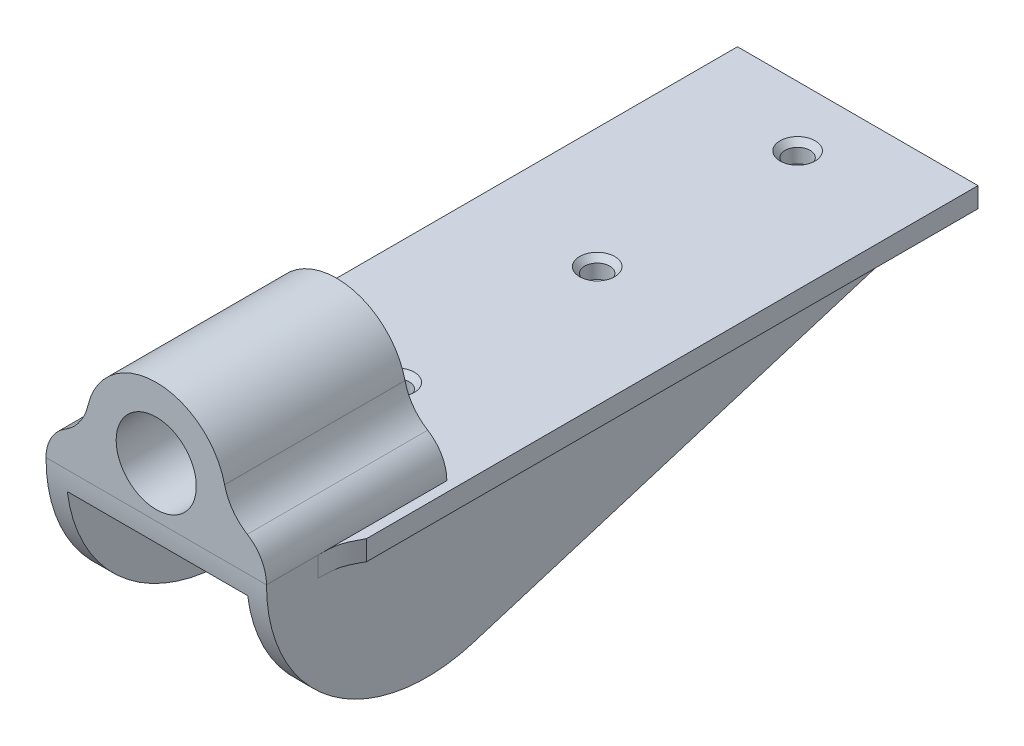
ISO-10303-21;
HEADER;
FILE_DESCRIPTION(('STEP AP214'),'2;1');
FILE_NAME('part.step','',(''),(''),'','','');
FILE_SCHEMA(('AUTOMOTIVE_DESIGN { 1 0 10303 214 1 1 1 1 }'));
ENDSEC;
DATA;
#1=APPLICATION_CONTEXT('core data for automotive mechanical design processes');
#2=APPLICATION_PROTOCOL_DEFINITION('international standard','automotive_design',2000,#1);
#3=PRODUCT_CONTEXT('',#1,'mechanical');
#4=PRODUCT('Part','Part','',(#3));
#5=PRODUCT_RELATED_PRODUCT_CATEGORY('part','',(#4));
#6=PRODUCT_DEFINITION_FORMATION('','',#4);
#7=PRODUCT_DEFINITION_CONTEXT('part definition',#1,'design');
#8=PRODUCT_DEFINITION('design','',#6,#7);
#9=PRODUCT_DEFINITION_SHAPE('','',#8);
#10=(LENGTH_UNIT() NAMED_UNIT(*) SI_UNIT(.MILLI.,.METRE.));
#11=(NAMED_UNIT(*) PLANE_ANGLE_UNIT() SI_UNIT($,.RADIAN.));
#12=(NAMED_UNIT(*) SI_UNIT($,.STERADIAN.) SOLID_ANGLE_UNIT());
#13=UNCERTAINTY_MEASURE_WITH_UNIT(LENGTH_MEASURE(1.E-05),#10,'distance_accuracy_value','');
#14=(GEOMETRIC_REPRESENTATION_CONTEXT(3) GLOBAL_UNCERTAINTY_ASSIGNED_CONTEXT((#13)) GLOBAL_UNIT_ASSIGNED_CONTEXT((#10,
#11,#12)) REPRESENTATION_CONTEXT('',''));
#15=CARTESIAN_POINT('',(0.,0.,0.));
#16=DIRECTION('',(0.,0.,1.));
#17=DIRECTION('',(1.,0.,0.));
#18=AXIS2_PLACEMENT_3D('',#15,#16,#17);
#19=CARTESIAN_POINT('',(34.925,0.,0.));
#20=DIRECTION('',(0.,1.,0.));
#21=DIRECTION('',(0.,0.,1.));
#22=AXIS2_PLACEMENT_3D('',#19,#20,#21);
#23=PLANE('',#22);
#24=CARTESIAN_POINT('',(0.,0.,-76.2));
#25=DIRECTION('',(0.,1.,0.));
#26=DIRECTION('',(0.,0.,1.));
#27=AXIS2_PLACEMENT_3D('',#24,#25,#26);
#28=CIRCLE('',#27,5.5626);
#29=CARTESIAN_POINT('',(0.,0.,-70.6374));
#30=VERTEX_POINT('',#29);
#31=EDGE_CURVE('E457',#30,#30,#28,.T.);
#32=ORIENTED_EDGE('',*,*,#31,.F.);
#33=EDGE_LOOP('',(#32));
#34=FACE_BOUND('',#33,.T.);
#35=CARTESIAN_POINT('',(0.,0.,-139.7));
#36=DIRECTION('',(0.,1.,0.));
#37=DIRECTION('',(0.,0.,1.));
#38=AXIS2_PLACEMENT_3D('',#35,#36,#37);
#39=CIRCLE('',#38,5.5626);
#40=CARTESIAN_POINT('',(0.,0.,-134.1374));
#41=VERTEX_POINT('',#40);
#42=EDGE_CURVE('E454',#41,#41,#39,.T.);
#43=ORIENTED_EDGE('',*,*,#42,.F.);
#44=EDGE_LOOP('',(#43));
#45=FACE_BOUND('',#44,.T.);
#46=CARTESIAN_POINT('',(0.,0.,-203.2));
#47=DIRECTION('',(0.,1.,0.));
#48=DIRECTION('',(0.,0.,1.));
#49=AXIS2_PLACEMENT_3D('',#46,#47,#48);
#50=CIRCLE('',#49,5.5626);
#51=CARTESIAN_POINT('',(0.,0.,-197.6374));
#52=VERTEX_POINT('',#51);
#53=EDGE_CURVE('E447',#52,#52,#50,.T.);
#54=ORIENTED_EDGE('',*,*,#53,.F.);
#55=EDGE_LOOP('',(#54));
#56=FACE_BOUND('',#55,.T.);
#57=CARTESIAN_POINT('',(-34.925,0.,-16.2782778757914));
#58=CARTESIAN_POINT('',(-34.925,0.,-22.8365296753693));
#59=CARTESIAN_POINT('',(-38.1,0.,-28.575));
#60=(BOUNDED_CURVE() B_SPLINE_CURVE(2,(#57,#58,#59),.UNSPECIFIED.,.F.,
.F.) B_SPLINE_CURVE_WITH_KNOTS((3,3),(0.,1.),
.UNSPECIFIED.) CURVE() GEOMETRIC_REPRESENTATION_ITEM() RATIONAL_B_SPLINE_CURVE((1.,
1.93649167310371,1.)) REPRESENTATION_ITEM(''));
#61=CARTESIAN_POINT('',(-38.1,0.,-28.575));
#62=VERTEX_POINT('',#61);
#63=CARTESIAN_POINT('',(-34.925,0.,-16.2782778757914));
#64=VERTEX_POINT('',#63);
#65=EDGE_CURVE('E12',#62,#64,#60,.F.);
#66=ORIENTED_EDGE('',*,*,#65,.T.);
#67=DIRECTION('',(0.,0.,-1.));
#68=VECTOR('',#67,1.);
#69=CARTESIAN_POINT('',(-34.925,0.,0.));
#70=LINE('',#69,#68);
#71=CARTESIAN_POINT('',(-34.925,0.,-57.15));
#72=VERTEX_POINT('',#71);
#73=EDGE_CURVE('E197',#64,#72,#70,.T.);
#74=ORIENTED_EDGE('',*,*,#73,.T.);
#75=DIRECTION('',(-1.,0.,0.));
#76=VECTOR('',#75,1.);
#77=CARTESIAN_POINT('',(0.,0.,-57.15));
#78=LINE('',#77,#76);
#79=CARTESIAN_POINT('',(34.925,0.,-57.15));
#80=VERTEX_POINT('',#79);
#81=EDGE_CURVE('E68',#80,#72,#78,.T.);
#82=ORIENTED_EDGE('',*,*,#81,.F.);
#83=DIRECTION('',(0.,0.,-1.));
#84=VECTOR('',#83,1.);
#85=CARTESIAN_POINT('',(34.925,0.,0.));
#86=LINE('',#85,#84);
#87=CARTESIAN_POINT('',(34.925,0.,-16.2782778757914));
#88=VERTEX_POINT('',#87);
#89=EDGE_CURVE('E244',#88,#80,#86,.T.);
#90=ORIENTED_EDGE('',*,*,#89,.F.);
#91=CARTESIAN_POINT('',(38.1,0.,-28.575));
#92=CARTESIAN_POINT('',(34.925,0.,-22.8365296753693));
#93=CARTESIAN_POINT('',(34.925,0.,-16.2782778757914));
#94=(BOUNDED_CURVE() B_SPLINE_CURVE(2,(#91,#92,#93),.UNSPECIFIED.,.F.,
.F.) B_SPLINE_CURVE_WITH_KNOTS((3,3),(0.,1.),
.UNSPECIFIED.) CURVE() GEOMETRIC_REPRESENTATION_ITEM() RATIONAL_B_SPLINE_CURVE((1.,
1.93649167310371,1.)) REPRESENTATION_ITEM(''));
#95=CARTESIAN_POINT('',(38.1,0.,-28.575));
#96=VERTEX_POINT('',#95);
#97=EDGE_CURVE('E387',#88,#96,#94,.F.);
#98=ORIENTED_EDGE('',*,*,#97,.T.);
#99=DIRECTION('',(0.,0.,-1.));
#100=VECTOR('',#99,1.);
#101=CARTESIAN_POINT('',(38.1,0.,0.));
#102=LINE('',#101,#100);
#103=CARTESIAN_POINT('',(38.1,0.,-222.25));
#104=VERTEX_POINT('',#103);
#105=EDGE_CURVE('E261',#96,#104,#102,.T.);
#106=ORIENTED_EDGE('',*,*,#105,.T.);
#107=DIRECTION('',(-1.,0.,0.));
#108=VECTOR('',#107,1.);
#109=CARTESIAN_POINT('',(34.925,0.,-222.25));
#110=LINE('',#109,#108);
#111=CARTESIAN_POINT('',(-38.1,0.,-222.25));
#112=VERTEX_POINT('',#111);
#113=EDGE_CURVE('E584',#104,#112,#110,.T.);
#114=ORIENTED_EDGE('',*,*,#113,.T.);
#115=DIRECTION('',(0.,0.,-1.));
#116=VECTOR('',#115,1.);
#117=CARTESIAN_POINT('',(-38.1,0.,0.));
#118=LINE('',#117,#116);
#119=EDGE_CURVE('E333',#62,#112,#118,.T.);
#120=ORIENTED_EDGE('',*,*,#119,.F.);
#121=EDGE_LOOP('',(#66,#74,#82,#90,#98,#106,#114,#120));
#122=FACE_BOUND('',#121,.T.);
#123=ADVANCED_FACE('F41',(#34,#45,#56,#122),#23,.T.);
#124=CARTESIAN_POINT('',(-34.925,0.,0.));
#125=DIRECTION('',(-1.,0.,0.));
#126=DIRECTION('',(0.,0.,-1.));
#127=AXIS2_PLACEMENT_3D('',#124,#125,#126);
#128=PLANE('',#127);
#129=DIRECTION('',(0.,0.,-1.));
#130=VECTOR('',#129,1.);
#131=CARTESIAN_POINT('',(-34.925,0.,0.));
#132=LINE('',#131,#130);
#133=CARTESIAN_POINT('',(-34.925,0.,0.));
#134=VERTEX_POINT('',#133);
#135=EDGE_CURVE('E194',#134,#64,#132,.T.);
#136=ORIENTED_EDGE('',*,*,#135,.T.);
#137=CARTESIAN_POINT('',(-34.925,-6.66750000000003,-16.2782778757914));
#138=CARTESIAN_POINT('',(-34.925,-4.33916666666668,-16.2782778757914));
#139=CARTESIAN_POINT('',(-34.925,-2.01083333333335,-16.2782778757914));
#140=CARTESIAN_POINT('',(-34.925,0.317500000000002,-16.2782778757914));
#141=(BOUNDED_CURVE() B_SPLINE_CURVE(3,(#137,#138,#139,#140),.UNSPECIFIED.,.F.,
.F.) B_SPLINE_CURVE_WITH_KNOTS((4,4),(-0.000317499999999992,0.00666750000000004),
.UNSPECIFIED.) CURVE() GEOMETRIC_REPRESENTATION_ITEM() RATIONAL_B_SPLINE_CURVE((1.,1.,1.,1.)) REPRESENTATION_ITEM(''));
#142=CARTESIAN_POINT('',(-34.925,-6.35000000000002,-16.2782778757914));
#143=VERTEX_POINT('',#142);
#144=EDGE_CURVE('E571',#64,#143,#141,.F.);
#145=ORIENTED_EDGE('',*,*,#144,.T.);
#146=DIRECTION('',(0.,0.,-1.));
#147=VECTOR('',#146,1.);
#148=CARTESIAN_POINT('',(-34.925,-6.35000000000003,0.));
#149=LINE('',#148,#147);
#150=CARTESIAN_POINT('',(-34.925,-6.35,-203.2));
#151=VERTEX_POINT('',#150);
#152=EDGE_CURVE('E60',#143,#151,#149,.T.);
#153=ORIENTED_EDGE('',*,*,#152,.T.);
#154=DIRECTION('',(0.,0.293501727372942,-0.955958543049383));
#155=VECTOR('',#154,1.);
#156=CARTESIAN_POINT('',(-34.925,-62.81592855795,-19.2859655602673));
#157=LINE('',#156,#155);
#158=CARTESIAN_POINT('',(-34.925,-48.5626939869087,-65.7098877505455));
#159=VERTEX_POINT('',#158);
#160=EDGE_CURVE('E201',#159,#151,#157,.T.);
#161=ORIENTED_EDGE('',*,*,#160,.F.);
#162=CARTESIAN_POINT('',(-34.925,0.,-50.8));
#163=DIRECTION('',(1.,0.,0.));
#164=DIRECTION('',(0.,0.,-1.));
#165=AXIS2_PLACEMENT_3D('',#162,#163,#164);
#166=CIRCLE('',#165,50.8);
#167=EDGE_CURVE('E172',#134,#159,#166,.T.);
#168=ORIENTED_EDGE('',*,*,#167,.F.);
#169=EDGE_LOOP('',(#136,#145,#153,#161,#168));
#170=FACE_BOUND('',#169,.T.);
#171=ADVANCED_FACE('F204',(#170),#128,.T.);
#172=CARTESIAN_POINT('',(34.925,0.,-50.8));
#173=DIRECTION('',(-1.,0.,0.));
#174=DIRECTION('',(0.,0.,1.));
#175=AXIS2_PLACEMENT_3D('',#172,#173,#174);
#176=CYLINDRICAL_SURFACE('',#175,50.8);
#177=CARTESIAN_POINT('',(-28.575,0.,-50.8));
#178=DIRECTION('',(1.,0.,0.));
#179=DIRECTION('',(0.,0.,-1.));
#180=AXIS2_PLACEMENT_3D('',#177,#178,#179);
#181=CIRCLE('',#180,50.8);
#182=CARTESIAN_POINT('',(-28.575,-6.35000000000002,-0.398437524219551));
#183=VERTEX_POINT('',#182);
#184=CARTESIAN_POINT('',(-28.575,-48.5626939869087,-65.7098877505455));
#185=VERTEX_POINT('',#184);
#186=EDGE_CURVE('E425',#183,#185,#181,.T.);
#187=ORIENTED_EDGE('',*,*,#186,.F.);
#188=DIRECTION('',(-1.,0.,0.));
#189=VECTOR('',#188,1.);
#190=CARTESIAN_POINT('',(28.575,-6.35000000000002,-0.398437524219551));
#191=LINE('',#190,#189);
#192=CARTESIAN_POINT('',(28.575,-6.35000000000002,-0.398437524219551));
#193=VERTEX_POINT('',#192);
#194=EDGE_CURVE('E255',#193,#183,#191,.T.);
#195=ORIENTED_EDGE('',*,*,#194,.F.);
#196=CARTESIAN_POINT('',(28.575,0.,-50.8));
#197=DIRECTION('',(1.,0.,0.));
#198=DIRECTION('',(0.,0.,-1.));
#199=AXIS2_PLACEMENT_3D('',#196,#197,#198);
#200=CIRCLE('',#199,50.8);
#201=CARTESIAN_POINT('',(28.575,-48.5626939869087,-65.7098877505455));
#202=VERTEX_POINT('',#201);
#203=EDGE_CURVE('E249',#193,#202,#200,.T.);
#204=ORIENTED_EDGE('',*,*,#203,.T.);
#205=DIRECTION('',(-1.,0.,0.));
#206=VECTOR('',#205,1.);
#207=CARTESIAN_POINT('',(34.925,-48.5626939869087,-65.7098877505455));
#208=LINE('',#207,#206);
#209=CARTESIAN_POINT('',(34.925,-48.5626939869087,-65.7098877505455));
#210=VERTEX_POINT('',#209);
#211=EDGE_CURVE('E180',#210,#202,#208,.T.);
#212=ORIENTED_EDGE('',*,*,#211,.F.);
#213=CARTESIAN_POINT('',(34.925,0.,-50.8));
#214=DIRECTION('',(1.,0.,0.));
#215=DIRECTION('',(0.,0.,-1.));
#216=AXIS2_PLACEMENT_3D('',#213,#214,#215);
#217=CIRCLE('',#216,50.8);
#218=CARTESIAN_POINT('',(34.925,0.,0.));
#219=VERTEX_POINT('',#218);
#220=EDGE_CURVE('E174',#219,#210,#217,.T.);
#221=ORIENTED_EDGE('',*,*,#220,.F.);
#222=DIRECTION('',(-1.,0.,0.));
#223=VECTOR('',#222,1.);
#224=CARTESIAN_POINT('',(34.925,0.,0.));
#225=LINE('',#224,#223);
#226=EDGE_CURVE('E166',#219,#134,#225,.T.);
#227=ORIENTED_EDGE('',*,*,#226,.T.);
#228=ORIENTED_EDGE('',*,*,#167,.T.);
#229=DIRECTION('',(1.,0.,0.));
#230=VECTOR('',#229,1.);
#231=CARTESIAN_POINT('',(-34.925,-48.5626939869087,-65.7098877505455));
#232=LINE('',#231,#230);
#233=EDGE_CURVE('E205',#159,#185,#232,.T.);
#234=ORIENTED_EDGE('',*,*,#233,.T.);
#235=EDGE_LOOP('',(#187,#195,#204,#212,#221,#227,#228,#234));
#236=FACE_BOUND('',#235,.T.);
#237=ADVANCED_FACE('F169',(#236),#176,.T.);
#238=CARTESIAN_POINT('',(34.925,-62.81592855795,-19.2859655602673));
#239=DIRECTION('',(0.,0.955958543049383,0.293501727372942));
#240=DIRECTION('',(0.,-0.293501727372942,0.955958543049383));
#241=AXIS2_PLACEMENT_3D('',#238,#239,#240);
#242=PLANE('',#241);
#243=ORIENTED_EDGE('',*,*,#211,.T.);
#244=DIRECTION('',(0.,0.293501727372942,-0.955958543049383));
#245=VECTOR('',#244,1.);
#246=CARTESIAN_POINT('',(28.575,-62.81592855795,-19.2859655602673));
#247=LINE('',#246,#245);
#248=CARTESIAN_POINT('',(28.575,-6.35,-203.2));
#249=VERTEX_POINT('',#248);
#250=EDGE_CURVE('E252',#202,#249,#247,.T.);
#251=ORIENTED_EDGE('',*,*,#250,.T.);
#252=DIRECTION('',(-1.,0.,0.));
#253=VECTOR('',#252,1.);
#254=CARTESIAN_POINT('',(34.925,-6.35,-203.2));
#255=LINE('',#254,#253);
#256=CARTESIAN_POINT('',(34.925,-6.35,-203.2));
#257=VERTEX_POINT('',#256);
#258=EDGE_CURVE('E587',#257,#249,#255,.T.);
#259=ORIENTED_EDGE('',*,*,#258,.F.);
#260=DIRECTION('',(0.,0.293501727372942,-0.955958543049383));
#261=VECTOR('',#260,1.);
#262=CARTESIAN_POINT('',(34.925,-62.81592855795,-19.2859655602673));
#263=LINE('',#262,#261);
#264=EDGE_CURVE('E585',#210,#257,#263,.T.);
#265=ORIENTED_EDGE('',*,*,#264,.F.);
#266=EDGE_LOOP('',(#243,#251,#259,#265));
#267=FACE_BOUND('',#266,.T.);
#268=ADVANCED_FACE('F303',(#267),#242,.F.);
#269=CARTESIAN_POINT('',(34.925,-6.35000000000003,0.));
#270=DIRECTION('',(0.,-1.,0.));
#271=DIRECTION('',(0.,0.,-1.));
#272=AXIS2_PLACEMENT_3D('',#269,#270,#271);
#273=PLANE('',#272);
#274=CARTESIAN_POINT('',(0.,-6.35000000000002,-76.2));
#275=DIRECTION('',(0.,-1.,0.));
#276=DIRECTION('',(0.,0.,-1.));
#277=AXIS2_PLACEMENT_3D('',#274,#275,#276);
#278=CIRCLE('',#277,3.96875);
#279=CARTESIAN_POINT('',(0.,-6.35000000000001,-80.16875));
#280=VERTEX_POINT('',#279);
#281=EDGE_CURVE('E529',#280,#280,#278,.T.);
#282=ORIENTED_EDGE('',*,*,#281,.F.);
#283=EDGE_LOOP('',(#282));
#284=FACE_BOUND('',#283,.T.);
#285=CARTESIAN_POINT('',(0.,-6.35000000000001,-139.7));
#286=DIRECTION('',(0.,-1.,0.));
#287=DIRECTION('',(0.,0.,-1.));
#288=AXIS2_PLACEMENT_3D('',#285,#286,#287);
#289=CIRCLE('',#288,3.96875);
#290=CARTESIAN_POINT('',(0.,-6.35000000000001,-143.66875));
#291=VERTEX_POINT('',#290);
#292=EDGE_CURVE('E526',#291,#291,#289,.T.);
#293=ORIENTED_EDGE('',*,*,#292,.F.);
#294=EDGE_LOOP('',(#293));
#295=FACE_BOUND('',#294,.T.);
#296=CARTESIAN_POINT('',(0.,-6.35,-203.2));
#297=DIRECTION('',(0.,-1.,0.));
#298=DIRECTION('',(0.,0.,-1.));
#299=AXIS2_PLACEMENT_3D('',#296,#297,#298);
#300=CIRCLE('',#299,3.96875);
#301=CARTESIAN_POINT('',(0.,-6.35,-207.16875));
#302=VERTEX_POINT('',#301);
#303=EDGE_CURVE('E445',#302,#302,#300,.T.);
#304=ORIENTED_EDGE('',*,*,#303,.F.);
#305=EDGE_LOOP('',(#304));
#306=FACE_BOUND('',#305,.T.);
#307=DIRECTION('',(0.,0.,1.));
#308=VECTOR('',#307,1.);
#309=CARTESIAN_POINT('',(-38.1,-6.35000000000003,0.));
#310=LINE('',#309,#308);
#311=CARTESIAN_POINT('',(-38.1,-6.35,-222.25));
#312=VERTEX_POINT('',#311);
#313=CARTESIAN_POINT('',(-38.1,-6.35000000000002,-28.575));
#314=VERTEX_POINT('',#313);
#315=EDGE_CURVE('E316',#312,#314,#310,.T.);
#316=ORIENTED_EDGE('',*,*,#315,.F.);
#317=DIRECTION('',(-1.,0.,0.));
#318=VECTOR('',#317,1.);
#319=CARTESIAN_POINT('',(34.925,-6.35,-222.25));
#320=LINE('',#319,#318);
#321=CARTESIAN_POINT('',(38.1,-6.35,-222.25));
#322=VERTEX_POINT('',#321);
#323=EDGE_CURVE('E538',#322,#312,#320,.T.);
#324=ORIENTED_EDGE('',*,*,#323,.F.);
#325=DIRECTION('',(0.,0.,1.));
#326=VECTOR('',#325,1.);
#327=CARTESIAN_POINT('',(38.1,-6.35000000000003,0.));
#328=LINE('',#327,#326);
#329=CARTESIAN_POINT('',(38.1,-6.35000000000002,-28.575));
#330=VERTEX_POINT('',#329);
#331=EDGE_CURVE('E262',#322,#330,#328,.T.);
#332=ORIENTED_EDGE('',*,*,#331,.T.);
#333=CARTESIAN_POINT('',(34.925,-6.35000000000003,-16.2782778757914));
#334=CARTESIAN_POINT('',(34.925,-6.35000000000002,-22.8365296753693));
#335=CARTESIAN_POINT('',(38.1,-6.35000000000002,-28.575));
#336=(BOUNDED_CURVE() B_SPLINE_CURVE(2,(#333,#334,#335),.UNSPECIFIED.,.F.,
.F.) B_SPLINE_CURVE_WITH_KNOTS((3,3),(0.,1.),
.UNSPECIFIED.) CURVE() GEOMETRIC_REPRESENTATION_ITEM() RATIONAL_B_SPLINE_CURVE((1.,
1.93649167310371,1.)) REPRESENTATION_ITEM(''));
#337=CARTESIAN_POINT('',(34.925,-6.35000000000002,-16.2782778757914));
#338=VERTEX_POINT('',#337);
#339=EDGE_CURVE('E367',#330,#338,#336,.F.);
#340=ORIENTED_EDGE('',*,*,#339,.T.);
#341=DIRECTION('',(0.,0.,-1.));
#342=VECTOR('',#341,1.);
#343=CARTESIAN_POINT('',(34.925,-6.35000000000003,0.));
#344=LINE('',#343,#342);
#345=EDGE_CURVE('E270',#338,#257,#344,.T.);
#346=ORIENTED_EDGE('',*,*,#345,.T.);
#347=ORIENTED_EDGE('',*,*,#258,.T.);
#348=DIRECTION('',(0.,0.,1.));
#349=VECTOR('',#348,1.);
#350=CARTESIAN_POINT('',(28.575,-6.35000000000002,0.));
#351=LINE('',#350,#349);
#352=EDGE_CURVE('E246',#249,#193,#351,.T.);
#353=ORIENTED_EDGE('',*,*,#352,.T.);
#354=ORIENTED_EDGE('',*,*,#194,.T.);
#355=DIRECTION('',(0.,0.,1.));
#356=VECTOR('',#355,1.);
#357=CARTESIAN_POINT('',(-28.575,-6.35000000000002,0.));
#358=LINE('',#357,#356);
#359=CARTESIAN_POINT('',(-28.575,-6.35,-203.2));
#360=VERTEX_POINT('',#359);
#361=EDGE_CURVE('E431',#360,#183,#358,.T.);
#362=ORIENTED_EDGE('',*,*,#361,.F.);
#363=DIRECTION('',(1.,0.,0.));
#364=VECTOR('',#363,1.);
#365=CARTESIAN_POINT('',(-34.925,-6.35,-203.2));
#366=LINE('',#365,#364);
#367=EDGE_CURVE('E207',#151,#360,#366,.T.);
#368=ORIENTED_EDGE('',*,*,#367,.F.);
#369=ORIENTED_EDGE('',*,*,#152,.F.);
#370=CARTESIAN_POINT('',(-38.1,-6.35000000000002,-28.575));
#371=CARTESIAN_POINT('',(-34.925,-6.35000000000002,-22.8365296753693));
#372=CARTESIAN_POINT('',(-34.925,-6.35000000000003,-16.2782778757914));
#373=(BOUNDED_CURVE() B_SPLINE_CURVE(2,(#370,#371,#372),.UNSPECIFIED.,.F.,
.F.) B_SPLINE_CURVE_WITH_KNOTS((3,3),(0.,1.),
.UNSPECIFIED.) CURVE() GEOMETRIC_REPRESENTATION_ITEM() RATIONAL_B_SPLINE_CURVE((1.,
1.93649167310371,1.)) REPRESENTATION_ITEM(''));
#374=EDGE_CURVE('E53',#143,#314,#373,.F.);
#375=ORIENTED_EDGE('',*,*,#374,.T.);
#376=EDGE_LOOP('',(#316,#324,#332,#340,#346,#347,#353,#354,#362,#368,#369,#375));
#377=FACE_BOUND('',#376,.T.);
#378=ADVANCED_FACE('F298',(#284,#295,#306,#377),#273,.T.);
#379=CARTESIAN_POINT('',(34.925,0.,-222.25));
#380=DIRECTION('',(0.,0.,-1.));
#381=DIRECTION('',(-1.,0.,0.));
#382=AXIS2_PLACEMENT_3D('',#379,#380,#381);
#383=PLANE('',#382);
#384=DIRECTION('',(0.,-1.,0.));
#385=VECTOR('',#384,1.);
#386=CARTESIAN_POINT('',(-38.1,0.,-222.25));
#387=LINE('',#386,#385);
#388=EDGE_CURVE('E324',#112,#312,#387,.T.);
#389=ORIENTED_EDGE('',*,*,#388,.F.);
#390=ORIENTED_EDGE('',*,*,#113,.F.);
#391=DIRECTION('',(0.,-1.,0.));
#392=VECTOR('',#391,1.);
#393=CARTESIAN_POINT('',(38.1,0.,-222.25));
#394=LINE('',#393,#392);
#395=EDGE_CURVE('E258',#104,#322,#394,.T.);
#396=ORIENTED_EDGE('',*,*,#395,.T.);
#397=ORIENTED_EDGE('',*,*,#323,.T.);
#398=EDGE_LOOP('',(#389,#390,#396,#397));
#399=FACE_BOUND('',#398,.T.);
#400=ADVANCED_FACE('F293',(#399),#383,.T.);
#401=CARTESIAN_POINT('',(34.925,0.,0.));
#402=DIRECTION('',(1.,0.,0.));
#403=DIRECTION('',(0.,0.,-1.));
#404=AXIS2_PLACEMENT_3D('',#401,#402,#403);
#405=PLANE('',#404);
#406=ORIENTED_EDGE('',*,*,#345,.F.);
#407=CARTESIAN_POINT('',(34.925,0.317500000000002,-16.2782778757914));
#408=CARTESIAN_POINT('',(34.925,-2.01083333333334,-16.2782778757914));
#409=CARTESIAN_POINT('',(34.925,-4.33916666666669,-16.2782778757914));
#410=CARTESIAN_POINT('',(34.925,-6.66750000000003,-16.2782778757914));
#411=(BOUNDED_CURVE() B_SPLINE_CURVE(3,(#407,#408,#409,#410),.UNSPECIFIED.,.F.,
.F.) B_SPLINE_CURVE_WITH_KNOTS((4,4),(-0.00666750000000004,0.000317499999999992),
.UNSPECIFIED.) CURVE() GEOMETRIC_REPRESENTATION_ITEM() RATIONAL_B_SPLINE_CURVE((1.,1.,1.,1.)) REPRESENTATION_ITEM(''));
#412=EDGE_CURVE('E179',#338,#88,#411,.F.);
#413=ORIENTED_EDGE('',*,*,#412,.T.);
#414=DIRECTION('',(0.,0.,-1.));
#415=VECTOR('',#414,1.);
#416=CARTESIAN_POINT('',(34.925,0.,0.));
#417=LINE('',#416,#415);
#418=EDGE_CURVE('E267',#219,#88,#417,.T.);
#419=ORIENTED_EDGE('',*,*,#418,.F.);
#420=ORIENTED_EDGE('',*,*,#220,.T.);
#421=ORIENTED_EDGE('',*,*,#264,.T.);
#422=EDGE_LOOP('',(#406,#413,#419,#420,#421));
#423=FACE_BOUND('',#422,.T.);
#424=ADVANCED_FACE('F282',(#423),#405,.T.);
#425=CARTESIAN_POINT('',(38.1,0.,0.));
#426=DIRECTION('',(1.,0.,0.));
#427=DIRECTION('',(0.,0.,-1.));
#428=AXIS2_PLACEMENT_3D('',#425,#426,#427);
#429=PLANE('',#428);
#430=CARTESIAN_POINT('',(38.1,-6.66750000000002,-28.575));
#431=CARTESIAN_POINT('',(38.1,-4.33916666666668,-28.575));
#432=CARTESIAN_POINT('',(38.1,-2.01083333333334,-28.575));
#433=CARTESIAN_POINT('',(38.1,0.317500000000009,-28.575));
#434=(BOUNDED_CURVE() B_SPLINE_CURVE(3,(#430,#431,#432,#433),.UNSPECIFIED.,.F.,
.F.) B_SPLINE_CURVE_WITH_KNOTS((4,4),(-0.00666750000000004,0.000317499999999993),
.UNSPECIFIED.) CURVE() GEOMETRIC_REPRESENTATION_ITEM() RATIONAL_B_SPLINE_CURVE((1.,1.,1.,1.)) REPRESENTATION_ITEM(''));
#435=EDGE_CURVE('E257',#330,#96,#434,.T.);
#436=ORIENTED_EDGE('',*,*,#435,.F.);
#437=ORIENTED_EDGE('',*,*,#331,.F.);
#438=ORIENTED_EDGE('',*,*,#395,.F.);
#439=ORIENTED_EDGE('',*,*,#105,.F.);
#440=EDGE_LOOP('',(#436,#437,#438,#439));
#441=FACE_BOUND('',#440,.T.);
#442=ADVANCED_FACE('F292',(#441),#429,.T.);
#443=CARTESIAN_POINT('',(28.575,0.,0.));
#444=DIRECTION('',(1.,0.,0.));
#445=DIRECTION('',(0.,0.,-1.));
#446=AXIS2_PLACEMENT_3D('',#443,#444,#445);
#447=PLANE('',#446);
#448=ORIENTED_EDGE('',*,*,#352,.F.);
#449=ORIENTED_EDGE('',*,*,#250,.F.);
#450=ORIENTED_EDGE('',*,*,#203,.F.);
#451=EDGE_LOOP('',(#448,#449,#450));
#452=FACE_BOUND('',#451,.T.);
#453=ADVANCED_FACE('F596',(#452),#447,.F.);
#454=CARTESIAN_POINT('',(34.925,-6.66750000000003,-16.2782778757914));
#455=CARTESIAN_POINT('',(34.925,-4.33916666666669,-16.2782778757914));
#456=CARTESIAN_POINT('',(34.925,-2.01083333333334,-16.2782778757914));
#457=CARTESIAN_POINT('',(34.925,0.317500000000002,-16.2782778757914));
#458=CARTESIAN_POINT('',(34.925,-6.66750000000003,-22.8365296753693));
#459=CARTESIAN_POINT('',(34.925,-4.33916666666668,-22.8365296753693));
#460=CARTESIAN_POINT('',(34.925,-2.01083333333334,-22.8365296753693));
#461=CARTESIAN_POINT('',(34.925,0.317500000000005,-22.8365296753693));
#462=CARTESIAN_POINT('',(38.1,-6.66750000000002,-28.575));
#463=CARTESIAN_POINT('',(38.1,-4.33916666666668,-28.575));
#464=CARTESIAN_POINT('',(38.1,-2.01083333333334,-28.575));
#465=CARTESIAN_POINT('',(38.1,0.317500000000009,-28.575));
#466=(BOUNDED_SURFACE() B_SPLINE_SURFACE(2,3,((#454,#455,#456,#457),(#458,#459,#460,#461),(#462,
#463,#464,#465)),.UNSPECIFIED.,.F.,.F.,.F.) B_SPLINE_SURFACE_WITH_KNOTS((3,3),(4,4),(0.,1.),
(-0.00666750000000004,0.000317499999999993),
.UNSPECIFIED.) GEOMETRIC_REPRESENTATION_ITEM() RATIONAL_B_SPLINE_SURFACE(((1.,1.,1.,1.),
(1.93649167310371,1.93649167310371,1.93649167310371,1.93649167310371),(1.,1.,1.,1.))) REPRESENTATION_ITEM('') SURFACE());
#467=ORIENTED_EDGE('',*,*,#97,.F.);
#468=ORIENTED_EDGE('',*,*,#412,.F.);
#469=ORIENTED_EDGE('',*,*,#339,.F.);
#470=ORIENTED_EDGE('',*,*,#435,.T.);
#471=EDGE_LOOP('',(#467,#468,#469,#470));
#472=FACE_BOUND('',#471,.T.);
#473=ADVANCED_FACE('F344',(#472),#466,.T.);
#474=CARTESIAN_POINT('',(22.225,0.,0.));
#475=DIRECTION('',(0.,0.,-1.));
#476=DIRECTION('',(-1.,0.,0.));
#477=AXIS2_PLACEMENT_3D('',#474,#475,#476);
#478=CYLINDRICAL_SURFACE('',#477,12.7);
#479=CARTESIAN_POINT('',(22.225,0.,-57.15));
#480=DIRECTION('',(0.,0.,-1.));
#481=DIRECTION('',(-1.,0.,0.));
#482=AXIS2_PLACEMENT_3D('',#479,#480,#481);
#483=CIRCLE('',#482,12.7);
#484=CARTESIAN_POINT('',(28.8539156153338,10.8327040836895,-57.15));
#485=VERTEX_POINT('',#484);
#486=EDGE_CURVE('E218',#485,#80,#483,.T.);
#487=ORIENTED_EDGE('',*,*,#486,.F.);
#488=DIRECTION('',(0.,0.,-1.));
#489=VECTOR('',#488,1.);
#490=CARTESIAN_POINT('',(28.8539156153338,10.8327040836895,0.));
#491=LINE('',#490,#489);
#492=CARTESIAN_POINT('',(28.8539156153338,10.8327040836895,0.));
#493=VERTEX_POINT('',#492);
#494=EDGE_CURVE('E241',#493,#485,#491,.T.);
#495=ORIENTED_EDGE('',*,*,#494,.F.);
#496=CARTESIAN_POINT('',(22.225,0.,0.));
#497=DIRECTION('',(0.,0.,-1.));
#498=DIRECTION('',(-1.,0.,0.));
#499=AXIS2_PLACEMENT_3D('',#496,#497,#498);
#500=CIRCLE('',#499,12.7);
#501=EDGE_CURVE('E224',#493,#219,#500,.T.);
#502=ORIENTED_EDGE('',*,*,#501,.T.);
#503=ORIENTED_EDGE('',*,*,#418,.T.);
#504=ORIENTED_EDGE('',*,*,#89,.T.);
#505=EDGE_LOOP('',(#487,#495,#502,#503,#504));
#506=FACE_BOUND('',#505,.T.);
#507=ADVANCED_FACE('F611',(#506),#478,.T.);
#508=CARTESIAN_POINT('',(37.140060134501,24.3735841883014,0.));
#509=DIRECTION('',(0.,0.,-1.));
#510=DIRECTION('',(-1.,0.,0.));
#511=AXIS2_PLACEMENT_3D('',#508,#509,#510);
#512=CYLINDRICAL_SURFACE('',#511,15.875);
#513=CARTESIAN_POINT('',(37.140060134501,24.3735841883014,-57.15));
#514=DIRECTION('',(0.,0.,1.));
#515=DIRECTION('',(-1.,0.,0.));
#516=AXIS2_PLACEMENT_3D('',#513,#514,#515);
#517=CIRCLE('',#516,15.875);
#518=CARTESIAN_POINT('',(21.6650350784589,20.8325074431758,-57.15));
#519=VERTEX_POINT('',#518);
#520=EDGE_CURVE('E234',#519,#485,#517,.T.);
#521=ORIENTED_EDGE('',*,*,#520,.F.);
#522=DIRECTION('',(0.,0.,-1.));
#523=VECTOR('',#522,1.);
#524=CARTESIAN_POINT('',(21.6650350784589,20.8325074431758,0.));
#525=LINE('',#524,#523);
#526=CARTESIAN_POINT('',(21.6650350784589,20.8325074431758,0.));
#527=VERTEX_POINT('',#526);
#528=EDGE_CURVE('E226',#527,#519,#525,.T.);
#529=ORIENTED_EDGE('',*,*,#528,.F.);
#530=CARTESIAN_POINT('',(37.140060134501,24.3735841883014,0.));
#531=DIRECTION('',(0.,0.,1.));
#532=DIRECTION('',(-1.,0.,0.));
#533=AXIS2_PLACEMENT_3D('',#530,#531,#532);
#534=CIRCLE('',#533,15.875);
#535=EDGE_CURVE('E221',#527,#493,#534,.T.);
#536=ORIENTED_EDGE('',*,*,#535,.T.);
#537=ORIENTED_EDGE('',*,*,#494,.T.);
#538=EDGE_LOOP('',(#521,#529,#536,#537));
#539=FACE_BOUND('',#538,.T.);
#540=ADVANCED_FACE('F614',(#539),#512,.F.);
#541=CARTESIAN_POINT('',(0.,15.875,0.));
#542=DIRECTION('',(0.,0.,-1.));
#543=DIRECTION('',(-1.,0.,0.));
#544=AXIS2_PLACEMENT_3D('',#541,#542,#543);
#545=CYLINDRICAL_SURFACE('',#544,22.225);
#546=CARTESIAN_POINT('',(0.,15.875,-57.15));
#547=DIRECTION('',(0.,0.,-1.));
#548=DIRECTION('',(-1.,0.,0.));
#549=AXIS2_PLACEMENT_3D('',#546,#547,#548);
#550=CIRCLE('',#549,22.225);
#551=CARTESIAN_POINT('',(-21.6650350784589,20.8325074431758,-57.15));
#552=VERTEX_POINT('',#551);
#553=EDGE_CURVE('E231',#552,#519,#550,.T.);
#554=ORIENTED_EDGE('',*,*,#553,.F.);
#555=DIRECTION('',(0.,0.,-1.));
#556=VECTOR('',#555,1.);
#557=CARTESIAN_POINT('',(-21.6650350784589,20.8325074431758,0.));
#558=LINE('',#557,#556);
#559=CARTESIAN_POINT('',(-21.6650350784589,20.8325074431758,0.));
#560=VERTEX_POINT('',#559);
#561=EDGE_CURVE('E434',#560,#552,#558,.T.);
#562=ORIENTED_EDGE('',*,*,#561,.F.);
#563=CARTESIAN_POINT('',(0.,15.875,0.));
#564=DIRECTION('',(0.,0.,-1.));
#565=DIRECTION('',(-1.,0.,0.));
#566=AXIS2_PLACEMENT_3D('',#563,#564,#565);
#567=CIRCLE('',#566,22.225);
#568=EDGE_CURVE('E217',#560,#527,#567,.T.);
#569=ORIENTED_EDGE('',*,*,#568,.T.);
#570=ORIENTED_EDGE('',*,*,#528,.T.);
#571=EDGE_LOOP('',(#554,#562,#569,#570));
#572=FACE_BOUND('',#571,.T.);
#573=ADVANCED_FACE('F618',(#572),#545,.T.);
#574=CARTESIAN_POINT('',(0.,15.875,0.));
#575=DIRECTION('',(0.,0.,-1.));
#576=DIRECTION('',(-1.,0.,0.));
#577=AXIS2_PLACEMENT_3D('',#574,#575,#576);
#578=CYLINDRICAL_SURFACE('',#577,12.7);
#579=CARTESIAN_POINT('',(0.,15.875,-57.15));
#580=DIRECTION('',(0.,0.,1.));
#581=DIRECTION('',(-1.,0.,0.));
#582=AXIS2_PLACEMENT_3D('',#579,#580,#581);
#583=CIRCLE('',#582,12.7);
#584=CARTESIAN_POINT('',(-12.7,15.875,-57.15));
#585=VERTEX_POINT('',#584);
#586=EDGE_CURVE('E228',#585,#585,#583,.T.);
#587=ORIENTED_EDGE('',*,*,#586,.F.);
#588=EDGE_LOOP('',(#587));
#589=FACE_BOUND('',#588,.T.);
#590=CARTESIAN_POINT('',(0.,15.875,0.));
#591=DIRECTION('',(0.,0.,1.));
#592=DIRECTION('',(-1.,0.,0.));
#593=AXIS2_PLACEMENT_3D('',#590,#591,#592);
#594=CIRCLE('',#593,12.7);
#595=CARTESIAN_POINT('',(-12.7,15.875,0.));
#596=VERTEX_POINT('',#595);
#597=EDGE_CURVE('E214',#596,#596,#594,.T.);
#598=ORIENTED_EDGE('',*,*,#597,.T.);
#599=EDGE_LOOP('',(#598));
#600=FACE_BOUND('',#599,.T.);
#601=ADVANCED_FACE('F608',(#589,#600),#578,.F.);
#602=CARTESIAN_POINT('',(22.225,0.,0.));
#603=DIRECTION('',(0.,0.,-1.));
#604=DIRECTION('',(-1.,0.,0.));
#605=AXIS2_PLACEMENT_3D('',#602,#603,#604);
#606=PLANE('',#605);
#607=ORIENTED_EDGE('',*,*,#597,.F.);
#608=EDGE_LOOP('',(#607));
#609=FACE_BOUND('',#608,.T.);
#610=ORIENTED_EDGE('',*,*,#226,.F.);
#611=ORIENTED_EDGE('',*,*,#501,.F.);
#612=ORIENTED_EDGE('',*,*,#535,.F.);
#613=ORIENTED_EDGE('',*,*,#568,.F.);
#614=CARTESIAN_POINT('',(-37.140060134501,24.3735841883014,0.));
#615=DIRECTION('',(0.,0.,-1.));
#616=DIRECTION('',(1.,0.,0.));
#617=AXIS2_PLACEMENT_3D('',#614,#615,#616);
#618=CIRCLE('',#617,15.875);
#619=CARTESIAN_POINT('',(-28.8539156153338,10.8327040836895,0.));
#620=VERTEX_POINT('',#619);
#621=EDGE_CURVE('E187',#560,#620,#618,.T.);
#622=ORIENTED_EDGE('',*,*,#621,.T.);
#623=CARTESIAN_POINT('',(-22.225,0.,0.));
#624=DIRECTION('',(0.,0.,1.));
#625=DIRECTION('',(1.,0.,0.));
#626=AXIS2_PLACEMENT_3D('',#623,#624,#625);
#627=CIRCLE('',#626,12.7);
#628=EDGE_CURVE('E183',#620,#134,#627,.T.);
#629=ORIENTED_EDGE('',*,*,#628,.T.);
#630=EDGE_LOOP('',(#610,#611,#612,#613,#622,#629));
#631=FACE_BOUND('',#630,.T.);
#632=ADVANCED_FACE('F185',(#609,#631),#606,.F.);
#633=CARTESIAN_POINT('',(22.225,0.,-57.15));
#634=DIRECTION('',(0.,0.,-1.));
#635=DIRECTION('',(-1.,0.,0.));
#636=AXIS2_PLACEMENT_3D('',#633,#634,#635);
#637=PLANE('',#636);
#638=ORIENTED_EDGE('',*,*,#586,.T.);
#639=EDGE_LOOP('',(#638));
#640=FACE_BOUND('',#639,.T.);
#641=ORIENTED_EDGE('',*,*,#81,.T.);
#642=CARTESIAN_POINT('',(-22.225,0.,-57.15));
#643=DIRECTION('',(0.,0.,1.));
#644=DIRECTION('',(1.,0.,0.));
#645=AXIS2_PLACEMENT_3D('',#642,#643,#644);
#646=CIRCLE('',#645,12.7);
#647=CARTESIAN_POINT('',(-28.8539156153338,10.8327040836895,-57.15));
#648=VERTEX_POINT('',#647);
#649=EDGE_CURVE('E443',#648,#72,#646,.T.);
#650=ORIENTED_EDGE('',*,*,#649,.F.);
#651=CARTESIAN_POINT('',(-37.140060134501,24.3735841883014,-57.15));
#652=DIRECTION('',(0.,0.,-1.));
#653=DIRECTION('',(1.,0.,0.));
#654=AXIS2_PLACEMENT_3D('',#651,#652,#653);
#655=CIRCLE('',#654,15.875);
#656=EDGE_CURVE('E191',#552,#648,#655,.T.);
#657=ORIENTED_EDGE('',*,*,#656,.F.);
#658=ORIENTED_EDGE('',*,*,#553,.T.);
#659=ORIENTED_EDGE('',*,*,#520,.T.);
#660=ORIENTED_EDGE('',*,*,#486,.T.);
#661=EDGE_LOOP('',(#641,#650,#657,#658,#659,#660));
#662=FACE_BOUND('',#661,.T.);
#663=ADVANCED_FACE('F600',(#640,#662),#637,.T.);
#664=CARTESIAN_POINT('',(-34.925,-62.81592855795,-19.2859655602673));
#665=DIRECTION('',(0.,-0.955958543049383,-0.293501727372942));
#666=DIRECTION('',(0.,0.293501727372942,-0.955958543049383));
#667=AXIS2_PLACEMENT_3D('',#664,#665,#666);
#668=PLANE('',#667);
#669=DIRECTION('',(0.,0.293501727372942,-0.955958543049383));
#670=VECTOR('',#669,1.);
#671=CARTESIAN_POINT('',(-28.575,-62.81592855795,-19.2859655602673));
#672=LINE('',#671,#670);
#673=EDGE_CURVE('E428',#185,#360,#672,.T.);
#674=ORIENTED_EDGE('',*,*,#673,.F.);
#675=ORIENTED_EDGE('',*,*,#233,.F.);
#676=ORIENTED_EDGE('',*,*,#160,.T.);
#677=ORIENTED_EDGE('',*,*,#367,.T.);
#678=EDGE_LOOP('',(#674,#675,#676,#677));
#679=FACE_BOUND('',#678,.T.);
#680=ADVANCED_FACE('F505',(#679),#668,.T.);
#681=CARTESIAN_POINT('',(-38.1,0.,0.));
#682=DIRECTION('',(-1.,0.,0.));
#683=DIRECTION('',(0.,0.,-1.));
#684=AXIS2_PLACEMENT_3D('',#681,#682,#683);
#685=PLANE('',#684);
#686=CARTESIAN_POINT('',(-38.1,0.317500000000008,-28.575));
#687=CARTESIAN_POINT('',(-38.1,-2.01083333333334,-28.575));
#688=CARTESIAN_POINT('',(-38.1,-4.33916666666668,-28.575));
#689=CARTESIAN_POINT('',(-38.1,-6.66750000000002,-28.575));
#690=(BOUNDED_CURVE() B_SPLINE_CURVE(3,(#686,#687,#688,#689),.UNSPECIFIED.,.F.,
.F.) B_SPLINE_CURVE_WITH_KNOTS((4,4),(-0.000317499999999993,0.00666750000000004),
.UNSPECIFIED.) CURVE() GEOMETRIC_REPRESENTATION_ITEM() RATIONAL_B_SPLINE_CURVE((1.,1.,1.,1.)) REPRESENTATION_ITEM(''));
#691=EDGE_CURVE('E427',#314,#62,#690,.F.);
#692=ORIENTED_EDGE('',*,*,#691,.T.);
#693=ORIENTED_EDGE('',*,*,#119,.T.);
#694=ORIENTED_EDGE('',*,*,#388,.T.);
#695=ORIENTED_EDGE('',*,*,#315,.T.);
#696=EDGE_LOOP('',(#692,#693,#694,#695));
#697=FACE_BOUND('',#696,.T.);
#698=ADVANCED_FACE('F500',(#697),#685,.T.);
#699=CARTESIAN_POINT('',(-28.575,0.,0.));
#700=DIRECTION('',(-1.,0.,0.));
#701=DIRECTION('',(0.,0.,-1.));
#702=AXIS2_PLACEMENT_3D('',#699,#700,#701);
#703=PLANE('',#702);
#704=ORIENTED_EDGE('',*,*,#361,.T.);
#705=ORIENTED_EDGE('',*,*,#186,.T.);
#706=ORIENTED_EDGE('',*,*,#673,.T.);
#707=EDGE_LOOP('',(#704,#705,#706));
#708=FACE_BOUND('',#707,.T.);
#709=ADVANCED_FACE('F497',(#708),#703,.F.);
#710=CARTESIAN_POINT('',(-34.925,0.317500000000002,-16.2782778757914));
#711=CARTESIAN_POINT('',(-34.925,-2.01083333333335,-16.2782778757914));
#712=CARTESIAN_POINT('',(-34.925,-4.33916666666668,-16.2782778757914));
#713=CARTESIAN_POINT('',(-34.925,-6.66750000000003,-16.2782778757914));
#714=CARTESIAN_POINT('',(-34.925,0.317500000000005,-22.8365296753693));
#715=CARTESIAN_POINT('',(-34.925,-2.01083333333334,-22.8365296753693));
#716=CARTESIAN_POINT('',(-34.925,-4.33916666666668,-22.8365296753693));
#717=CARTESIAN_POINT('',(-34.925,-6.66750000000003,-22.8365296753693));
#718=CARTESIAN_POINT('',(-38.1,0.317500000000008,-28.575));
#719=CARTESIAN_POINT('',(-38.1,-2.01083333333334,-28.575));
#720=CARTESIAN_POINT('',(-38.1,-4.33916666666668,-28.575));
#721=CARTESIAN_POINT('',(-38.1,-6.66750000000002,-28.575));
#722=(BOUNDED_SURFACE() B_SPLINE_SURFACE(2,3,((#710,#711,#712,#713),(#714,#715,#716,#717),(#718,
#719,#720,#721)),.UNSPECIFIED.,.F.,.F.,.F.) B_SPLINE_SURFACE_WITH_KNOTS((3,3),(4,4),(0.,1.),
(-0.000317499999999993,0.00666750000000004),
.UNSPECIFIED.) GEOMETRIC_REPRESENTATION_ITEM() RATIONAL_B_SPLINE_SURFACE(((1.,1.,1.,1.),
(1.93649167310371,1.93649167310371,1.93649167310371,1.93649167310371),(1.,1.,1.,1.))) REPRESENTATION_ITEM('') SURFACE());
#723=ORIENTED_EDGE('',*,*,#65,.F.);
#724=ORIENTED_EDGE('',*,*,#691,.F.);
#725=ORIENTED_EDGE('',*,*,#374,.F.);
#726=ORIENTED_EDGE('',*,*,#144,.F.);
#727=EDGE_LOOP('',(#723,#724,#725,#726));
#728=FACE_BOUND('',#727,.T.);
#729=ADVANCED_FACE('F44',(#728),#722,.T.);
#730=CARTESIAN_POINT('',(-37.140060134501,24.3735841883014,0.));
#731=DIRECTION('',(0.,0.,-1.));
#732=DIRECTION('',(-1.,0.,0.));
#733=AXIS2_PLACEMENT_3D('',#730,#731,#732);
#734=CYLINDRICAL_SURFACE('',#733,15.875);
#735=ORIENTED_EDGE('',*,*,#656,.T.);
#736=DIRECTION('',(0.,0.,-1.));
#737=VECTOR('',#736,1.);
#738=CARTESIAN_POINT('',(-28.8539156153338,10.8327040836895,0.));
#739=LINE('',#738,#737);
#740=EDGE_CURVE('E436',#620,#648,#739,.T.);
#741=ORIENTED_EDGE('',*,*,#740,.F.);
#742=ORIENTED_EDGE('',*,*,#621,.F.);
#743=ORIENTED_EDGE('',*,*,#561,.T.);
#744=EDGE_LOOP('',(#735,#741,#742,#743));
#745=FACE_BOUND('',#744,.T.);
#746=ADVANCED_FACE('F491',(#745),#734,.F.);
#747=CARTESIAN_POINT('',(-22.225,0.,0.));
#748=DIRECTION('',(0.,0.,-1.));
#749=DIRECTION('',(-1.,0.,0.));
#750=AXIS2_PLACEMENT_3D('',#747,#748,#749);
#751=CYLINDRICAL_SURFACE('',#750,12.7);
#752=ORIENTED_EDGE('',*,*,#649,.T.);
#753=ORIENTED_EDGE('',*,*,#73,.F.);
#754=ORIENTED_EDGE('',*,*,#135,.F.);
#755=ORIENTED_EDGE('',*,*,#628,.F.);
#756=ORIENTED_EDGE('',*,*,#740,.T.);
#757=EDGE_LOOP('',(#752,#753,#754,#755,#756));
#758=FACE_BOUND('',#757,.T.);
#759=ADVANCED_FACE('F196',(#758),#751,.T.);
#760=CARTESIAN_POINT('',(0.,-50.8,-203.2));
#761=DIRECTION('',(0.,1.,0.));
#762=DIRECTION('',(0.,0.,1.));
#763=AXIS2_PLACEMENT_3D('',#760,#761,#762);
#764=CYLINDRICAL_SURFACE('',#763,3.96875);
#765=CARTESIAN_POINT('',(0.,-1.83351468584921,-203.2));
#766=DIRECTION('',(0.,1.,0.));
#767=DIRECTION('',(0.,0.,1.));
#768=AXIS2_PLACEMENT_3D('',#765,#766,#767);
#769=CIRCLE('',#768,3.96875);
#770=CARTESIAN_POINT('',(0.,-1.83351468584921,-199.23125));
#771=VERTEX_POINT('',#770);
#772=EDGE_CURVE('E450',#771,#771,#769,.T.);
#773=ORIENTED_EDGE('',*,*,#772,.T.);
#774=EDGE_LOOP('',(#773));
#775=FACE_BOUND('',#774,.T.);
#776=ORIENTED_EDGE('',*,*,#303,.T.);
#777=EDGE_LOOP('',(#776));
#778=FACE_BOUND('',#777,.T.);
#779=ADVANCED_FACE('F486',(#775,#778),#764,.F.);
#780=CARTESIAN_POINT('',(0.,-50.8,-139.7));
#781=DIRECTION('',(0.,1.,0.));
#782=DIRECTION('',(0.,0.,1.));
#783=AXIS2_PLACEMENT_3D('',#780,#781,#782);
#784=CYLINDRICAL_SURFACE('',#783,3.96875);
#785=CARTESIAN_POINT('',(0.,-1.83351468584921,-139.7));
#786=DIRECTION('',(0.,1.,0.));
#787=DIRECTION('',(0.,0.,1.));
#788=AXIS2_PLACEMENT_3D('',#785,#786,#787);
#789=CIRCLE('',#788,3.96875);
#790=CARTESIAN_POINT('',(0.,-1.83351468584921,-135.73125));
#791=VERTEX_POINT('',#790);
#792=EDGE_CURVE('E451',#791,#791,#789,.T.);
#793=ORIENTED_EDGE('',*,*,#792,.T.);
#794=EDGE_LOOP('',(#793));
#795=FACE_BOUND('',#794,.T.);
#796=ORIENTED_EDGE('',*,*,#292,.T.);
#797=EDGE_LOOP('',(#796));
#798=FACE_BOUND('',#797,.T.);
#799=ADVANCED_FACE('F483',(#795,#798),#784,.F.);
#800=CARTESIAN_POINT('',(0.,-50.8,-76.2));
#801=DIRECTION('',(0.,1.,0.));
#802=DIRECTION('',(0.,0.,1.));
#803=AXIS2_PLACEMENT_3D('',#800,#801,#802);
#804=CYLINDRICAL_SURFACE('',#803,3.96875);
#805=CARTESIAN_POINT('',(0.,-1.83351468584921,-76.2));
#806=DIRECTION('',(0.,1.,0.));
#807=DIRECTION('',(0.,0.,1.));
#808=AXIS2_PLACEMENT_3D('',#805,#806,#807);
#809=CIRCLE('',#808,3.96875);
#810=CARTESIAN_POINT('',(0.,-1.83351468584921,-72.23125));
#811=VERTEX_POINT('',#810);
#812=EDGE_CURVE('E48',#811,#811,#809,.T.);
#813=ORIENTED_EDGE('',*,*,#812,.T.);
#814=EDGE_LOOP('',(#813));
#815=FACE_BOUND('',#814,.T.);
#816=ORIENTED_EDGE('',*,*,#281,.T.);
#817=EDGE_LOOP('',(#816));
#818=FACE_BOUND('',#817,.T.);
#819=ADVANCED_FACE('F464',(#815,#818),#804,.F.);
#820=CARTESIAN_POINT('',(0.,0.,-203.2));
#821=DIRECTION('',(0.,1.,0.));
#822=DIRECTION('',(0.,0.,1.));
#823=AXIS2_PLACEMENT_3D('',#820,#821,#822);
#824=CONICAL_SURFACE('',#823,5.5626,0.715584993317675);
#825=ORIENTED_EDGE('',*,*,#53,.T.);
#826=EDGE_LOOP('',(#825));
#827=FACE_BOUND('',#826,.T.);
#828=ORIENTED_EDGE('',*,*,#772,.F.);
#829=EDGE_LOOP('',(#828));
#830=FACE_BOUND('',#829,.T.);
#831=ADVANCED_FACE('F474',(#827,#830),#824,.F.);
#832=CARTESIAN_POINT('',(0.,0.,-139.7));
#833=DIRECTION('',(0.,1.,0.));
#834=DIRECTION('',(0.,0.,1.));
#835=AXIS2_PLACEMENT_3D('',#832,#833,#834);
#836=CONICAL_SURFACE('',#835,5.5626,0.715584993317675);
#837=ORIENTED_EDGE('',*,*,#42,.T.);
#838=EDGE_LOOP('',(#837));
#839=FACE_BOUND('',#838,.T.);
#840=ORIENTED_EDGE('',*,*,#792,.F.);
#841=EDGE_LOOP('',(#840));
#842=FACE_BOUND('',#841,.T.);
#843=ADVANCED_FACE('F469',(#839,#842),#836,.F.);
#844=CARTESIAN_POINT('',(0.,0.,-76.2));
#845=DIRECTION('',(0.,1.,0.));
#846=DIRECTION('',(0.,0.,1.));
#847=AXIS2_PLACEMENT_3D('',#844,#845,#846);
#848=CONICAL_SURFACE('',#847,5.5626,0.715584993317675);
#849=ORIENTED_EDGE('',*,*,#31,.T.);
#850=EDGE_LOOP('',(#849));
#851=FACE_BOUND('',#850,.T.);
#852=ORIENTED_EDGE('',*,*,#812,.F.);
#853=EDGE_LOOP('',(#852));
#854=FACE_BOUND('',#853,.T.);
#855=ADVANCED_FACE('F467',(#851,#854),#848,.F.);
#856=CLOSED_SHELL('',(#123,#171,#237,#268,#378,#400,#424,#442,#453,#473,#507,#540,#573,#601,
#632,#663,#680,#698,#709,#729,#746,#759,#779,#799,#819,#831,#843,#855));
#857=MANIFOLD_SOLID_BREP('B2',#856);
#858=ADVANCED_BREP_SHAPE_REPRESENTATION('',(#18,#857),#14);
#859=SHAPE_DEFINITION_REPRESENTATION(#9,#858);
ENDSEC;
END-ISO-10303-21;
